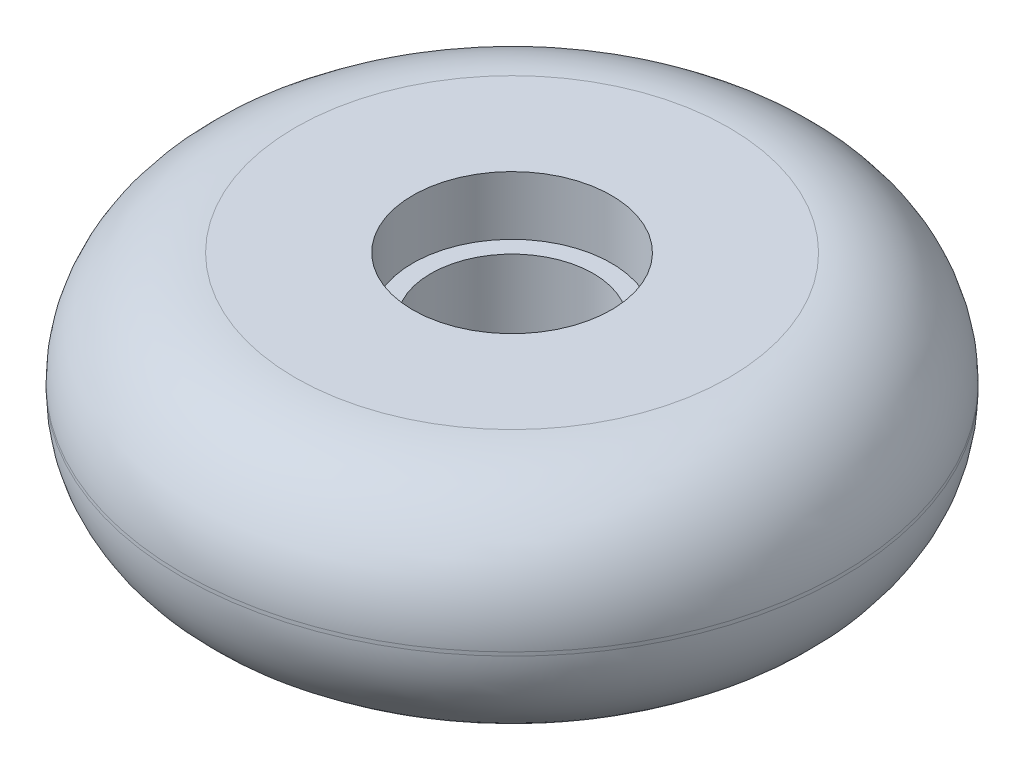
ISO-10303-21;
HEADER;
FILE_DESCRIPTION(('STEP AP214'),'2;1');
FILE_NAME('part.step','',(''),(''),'','','');
FILE_SCHEMA(('AUTOMOTIVE_DESIGN { 1 0 10303 214 1 1 1 1 }'));
ENDSEC;
DATA;
#1=APPLICATION_CONTEXT('core data for automotive mechanical design processes');
#2=APPLICATION_PROTOCOL_DEFINITION('international standard','automotive_design',2000,#1);
#3=PRODUCT_CONTEXT('',#1,'mechanical');
#4=PRODUCT('Part','Part','',(#3));
#5=PRODUCT_RELATED_PRODUCT_CATEGORY('part','',(#4));
#6=PRODUCT_DEFINITION_FORMATION('','',#4);
#7=PRODUCT_DEFINITION_CONTEXT('part definition',#1,'design');
#8=PRODUCT_DEFINITION('design','',#6,#7);
#9=PRODUCT_DEFINITION_SHAPE('','',#8);
#10=(LENGTH_UNIT() NAMED_UNIT(*) SI_UNIT(.MILLI.,.METRE.));
#11=(NAMED_UNIT(*) PLANE_ANGLE_UNIT() SI_UNIT($,.RADIAN.));
#12=(NAMED_UNIT(*) SI_UNIT($,.STERADIAN.) SOLID_ANGLE_UNIT());
#13=UNCERTAINTY_MEASURE_WITH_UNIT(LENGTH_MEASURE(1.E-05),#10,'distance_accuracy_value','');
#14=(GEOMETRIC_REPRESENTATION_CONTEXT(3) GLOBAL_UNCERTAINTY_ASSIGNED_CONTEXT((#13)) GLOBAL_UNIT_ASSIGNED_CONTEXT((#10,
#11,#12)) REPRESENTATION_CONTEXT('',''));
#15=CARTESIAN_POINT('',(0.,0.,0.));
#16=DIRECTION('',(0.,0.,1.));
#17=DIRECTION('',(1.,0.,0.));
#18=AXIS2_PLACEMENT_3D('',#15,#16,#17);
#19=CARTESIAN_POINT('',(0.,25.4,0.));
#20=DIRECTION('',(0.,-1.,0.));
#21=DIRECTION('',(0.,0.,-1.));
#22=AXIS2_PLACEMENT_3D('',#19,#20,#21);
#23=CYLINDRICAL_SURFACE('',#22,36.5125);
#24=CARTESIAN_POINT('',(0.,12.5,0.));
#25=DIRECTION('',(0.,1.,0.));
#26=DIRECTION('',(0.,0.,1.));
#27=AXIS2_PLACEMENT_3D('',#24,#25,#26);
#28=CIRCLE('',#27,36.5125);
#29=CARTESIAN_POINT('',(0.,12.5,36.5125));
#30=VERTEX_POINT('',#29);
#31=EDGE_CURVE('E45',#30,#30,#28,.T.);
#32=ORIENTED_EDGE('',*,*,#31,.T.);
#33=EDGE_LOOP('',(#32));
#34=FACE_BOUND('',#33,.T.);
#35=CARTESIAN_POINT('',(0.,12.9,0.));
#36=DIRECTION('',(0.,1.,0.));
#37=DIRECTION('',(0.,0.,1.));
#38=AXIS2_PLACEMENT_3D('',#35,#36,#37);
#39=CIRCLE('',#38,36.5125);
#40=CARTESIAN_POINT('',(0.,12.9,36.5125));
#41=VERTEX_POINT('',#40);
#42=EDGE_CURVE('E49',#41,#41,#39,.F.);
#43=ORIENTED_EDGE('',*,*,#42,.T.);
#44=EDGE_LOOP('',(#43));
#45=FACE_BOUND('',#44,.T.);
#46=ADVANCED_FACE('F34',(#34,#45),#23,.T.);
#47=CARTESIAN_POINT('',(0.,25.4,0.));
#48=DIRECTION('',(0.,1.,0.));
#49=DIRECTION('',(0.,0.,1.));
#50=AXIS2_PLACEMENT_3D('',#47,#48,#49);
#51=PLANE('',#50);
#52=CARTESIAN_POINT('',(0.,25.4,0.));
#53=DIRECTION('',(0.,1.,0.));
#54=DIRECTION('',(0.,0.,1.));
#55=AXIS2_PLACEMENT_3D('',#52,#53,#54);
#56=CIRCLE('',#55,11.);
#57=CARTESIAN_POINT('',(0.,25.4,11.));
#58=VERTEX_POINT('',#57);
#59=EDGE_CURVE('E55',#58,#58,#56,.T.);
#60=ORIENTED_EDGE('',*,*,#59,.F.);
#61=EDGE_LOOP('',(#60));
#62=FACE_BOUND('',#61,.T.);
#63=CARTESIAN_POINT('',(0.,25.4,0.));
#64=DIRECTION('',(0.,1.,0.));
#65=DIRECTION('',(0.,0.,1.));
#66=AXIS2_PLACEMENT_3D('',#63,#64,#65);
#67=CIRCLE('',#66,24.0125);
#68=CARTESIAN_POINT('',(0.,25.4,24.0125));
#69=VERTEX_POINT('',#68);
#70=EDGE_CURVE('E10',#69,#69,#67,.T.);
#71=ORIENTED_EDGE('',*,*,#70,.T.);
#72=EDGE_LOOP('',(#71));
#73=FACE_BOUND('',#72,.T.);
#74=ADVANCED_FACE('F91',(#62,#73),#51,.T.);
#75=CARTESIAN_POINT('',(0.,0.,0.));
#76=DIRECTION('',(0.,1.,0.));
#77=DIRECTION('',(0.,0.,1.));
#78=AXIS2_PLACEMENT_3D('',#75,#76,#77);
#79=PLANE('',#78);
#80=CARTESIAN_POINT('',(0.,0.,0.));
#81=DIRECTION('',(0.,-1.,0.));
#82=DIRECTION('',(0.,0.,-1.));
#83=AXIS2_PLACEMENT_3D('',#80,#81,#82);
#84=CIRCLE('',#83,11.);
#85=CARTESIAN_POINT('',(0.,0.,-11.));
#86=VERTEX_POINT('',#85);
#87=EDGE_CURVE('E61',#86,#86,#84,.T.);
#88=ORIENTED_EDGE('',*,*,#87,.F.);
#89=EDGE_LOOP('',(#88));
#90=FACE_BOUND('',#89,.T.);
#91=CARTESIAN_POINT('',(0.,0.,0.));
#92=DIRECTION('',(0.,1.,0.));
#93=DIRECTION('',(0.,0.,1.));
#94=AXIS2_PLACEMENT_3D('',#91,#92,#93);
#95=CIRCLE('',#94,24.0125);
#96=CARTESIAN_POINT('',(0.,0.,24.0125));
#97=VERTEX_POINT('',#96);
#98=EDGE_CURVE('E41',#97,#97,#95,.F.);
#99=ORIENTED_EDGE('',*,*,#98,.T.);
#100=EDGE_LOOP('',(#99));
#101=FACE_BOUND('',#100,.T.);
#102=ADVANCED_FACE('F88',(#90,#101),#79,.F.);
#103=CARTESIAN_POINT('',(0.,12.5,0.));
#104=DIRECTION('',(0.,1.,0.));
#105=DIRECTION('',(0.,0.,1.));
#106=AXIS2_PLACEMENT_3D('',#103,#104,#105);
#107=TOROIDAL_SURFACE('',#106,24.0125,12.5);
#108=ORIENTED_EDGE('',*,*,#98,.F.);
#109=EDGE_LOOP('',(#108));
#110=FACE_BOUND('',#109,.T.);
#111=ORIENTED_EDGE('',*,*,#31,.F.);
#112=EDGE_LOOP('',(#111));
#113=FACE_BOUND('',#112,.T.);
#114=ADVANCED_FACE('F90',(#110,#113),#107,.T.);
#115=CARTESIAN_POINT('',(0.,12.9,0.));
#116=DIRECTION('',(0.,1.,0.));
#117=DIRECTION('',(0.,0.,1.));
#118=AXIS2_PLACEMENT_3D('',#115,#116,#117);
#119=TOROIDAL_SURFACE('',#118,24.0125,12.5);
#120=ORIENTED_EDGE('',*,*,#42,.F.);
#121=EDGE_LOOP('',(#120));
#122=FACE_BOUND('',#121,.T.);
#123=ORIENTED_EDGE('',*,*,#70,.F.);
#124=EDGE_LOOP('',(#123));
#125=FACE_BOUND('',#124,.T.);
#126=ADVANCED_FACE('F36',(#122,#125),#119,.T.);
#127=CARTESIAN_POINT('',(0.,18.9,0.));
#128=DIRECTION('',(0.,1.,0.));
#129=DIRECTION('',(0.,0.,1.));
#130=AXIS2_PLACEMENT_3D('',#127,#128,#129);
#131=CYLINDRICAL_SURFACE('',#130,11.);
#132=CARTESIAN_POINT('',(0.,18.9,0.));
#133=DIRECTION('',(0.,1.,0.));
#134=DIRECTION('',(0.,0.,1.));
#135=AXIS2_PLACEMENT_3D('',#132,#133,#134);
#136=CIRCLE('',#135,11.);
#137=CARTESIAN_POINT('',(0.,18.9,11.));
#138=VERTEX_POINT('',#137);
#139=EDGE_CURVE('E54',#138,#138,#136,.T.);
#140=ORIENTED_EDGE('',*,*,#139,.F.);
#141=EDGE_LOOP('',(#140));
#142=FACE_BOUND('',#141,.T.);
#143=ORIENTED_EDGE('',*,*,#59,.T.);
#144=EDGE_LOOP('',(#143));
#145=FACE_BOUND('',#144,.T.);
#146=ADVANCED_FACE('F111',(#142,#145),#131,.F.);
#147=CARTESIAN_POINT('',(0.,18.9,0.));
#148=DIRECTION('',(0.,1.,0.));
#149=DIRECTION('',(0.,0.,1.));
#150=AXIS2_PLACEMENT_3D('',#147,#148,#149);
#151=PLANE('',#150);
#152=CARTESIAN_POINT('',(0.,18.9,0.));
#153=DIRECTION('',(0.,1.,0.));
#154=DIRECTION('',(0.,0.,1.));
#155=AXIS2_PLACEMENT_3D('',#152,#153,#154);
#156=CIRCLE('',#155,9.);
#157=CARTESIAN_POINT('',(0.,18.9,9.));
#158=VERTEX_POINT('',#157);
#159=EDGE_CURVE('E64',#158,#158,#156,.T.);
#160=ORIENTED_EDGE('',*,*,#159,.F.);
#161=EDGE_LOOP('',(#160));
#162=FACE_BOUND('',#161,.T.);
#163=ORIENTED_EDGE('',*,*,#139,.T.);
#164=EDGE_LOOP('',(#163));
#165=FACE_BOUND('',#164,.T.);
#166=ADVANCED_FACE('F84',(#162,#165),#151,.T.);
#167=CARTESIAN_POINT('',(0.,6.5,0.));
#168=DIRECTION('',(0.,-1.,0.));
#169=DIRECTION('',(0.,0.,-1.));
#170=AXIS2_PLACEMENT_3D('',#167,#168,#169);
#171=CYLINDRICAL_SURFACE('',#170,11.);
#172=CARTESIAN_POINT('',(0.,6.5,0.));
#173=DIRECTION('',(0.,-1.,0.));
#174=DIRECTION('',(0.,0.,-1.));
#175=AXIS2_PLACEMENT_3D('',#172,#173,#174);
#176=CIRCLE('',#175,11.);
#177=CARTESIAN_POINT('',(0.,6.5,-11.));
#178=VERTEX_POINT('',#177);
#179=EDGE_CURVE('E58',#178,#178,#176,.T.);
#180=ORIENTED_EDGE('',*,*,#179,.F.);
#181=EDGE_LOOP('',(#180));
#182=FACE_BOUND('',#181,.T.);
#183=ORIENTED_EDGE('',*,*,#87,.T.);
#184=EDGE_LOOP('',(#183));
#185=FACE_BOUND('',#184,.T.);
#186=ADVANCED_FACE('F78',(#182,#185),#171,.F.);
#187=CARTESIAN_POINT('',(0.,6.5,0.));
#188=DIRECTION('',(0.,-1.,0.));
#189=DIRECTION('',(0.,0.,-1.));
#190=AXIS2_PLACEMENT_3D('',#187,#188,#189);
#191=PLANE('',#190);
#192=CARTESIAN_POINT('',(0.,6.5,0.));
#193=DIRECTION('',(0.,-1.,0.));
#194=DIRECTION('',(0.,0.,-1.));
#195=AXIS2_PLACEMENT_3D('',#192,#193,#194);
#196=CIRCLE('',#195,9.);
#197=CARTESIAN_POINT('',(0.,6.5,-9.));
#198=VERTEX_POINT('',#197);
#199=EDGE_CURVE('E69',#198,#198,#196,.T.);
#200=ORIENTED_EDGE('',*,*,#199,.F.);
#201=EDGE_LOOP('',(#200));
#202=FACE_BOUND('',#201,.T.);
#203=ORIENTED_EDGE('',*,*,#179,.T.);
#204=EDGE_LOOP('',(#203));
#205=FACE_BOUND('',#204,.T.);
#206=ADVANCED_FACE('F75',(#202,#205),#191,.T.);
#207=CARTESIAN_POINT('',(0.,25.4,0.));
#208=DIRECTION('',(0.,-1.,0.));
#209=DIRECTION('',(0.,0.,-1.));
#210=AXIS2_PLACEMENT_3D('',#207,#208,#209);
#211=CYLINDRICAL_SURFACE('',#210,9.);
#212=ORIENTED_EDGE('',*,*,#159,.T.);
#213=EDGE_LOOP('',(#212));
#214=FACE_BOUND('',#213,.T.);
#215=ORIENTED_EDGE('',*,*,#199,.T.);
#216=EDGE_LOOP('',(#215));
#217=FACE_BOUND('',#216,.T.);
#218=ADVANCED_FACE('F73',(#214,#217),#211,.F.);
#219=CLOSED_SHELL('',(#46,#74,#102,#114,#126,#146,#166,#186,#206,#218));
#220=MANIFOLD_SOLID_BREP('B2',#219);
#221=ADVANCED_BREP_SHAPE_REPRESENTATION('',(#18,#220),#14);
#222=SHAPE_DEFINITION_REPRESENTATION(#9,#221);
ENDSEC;
END-ISO-10303-21;
